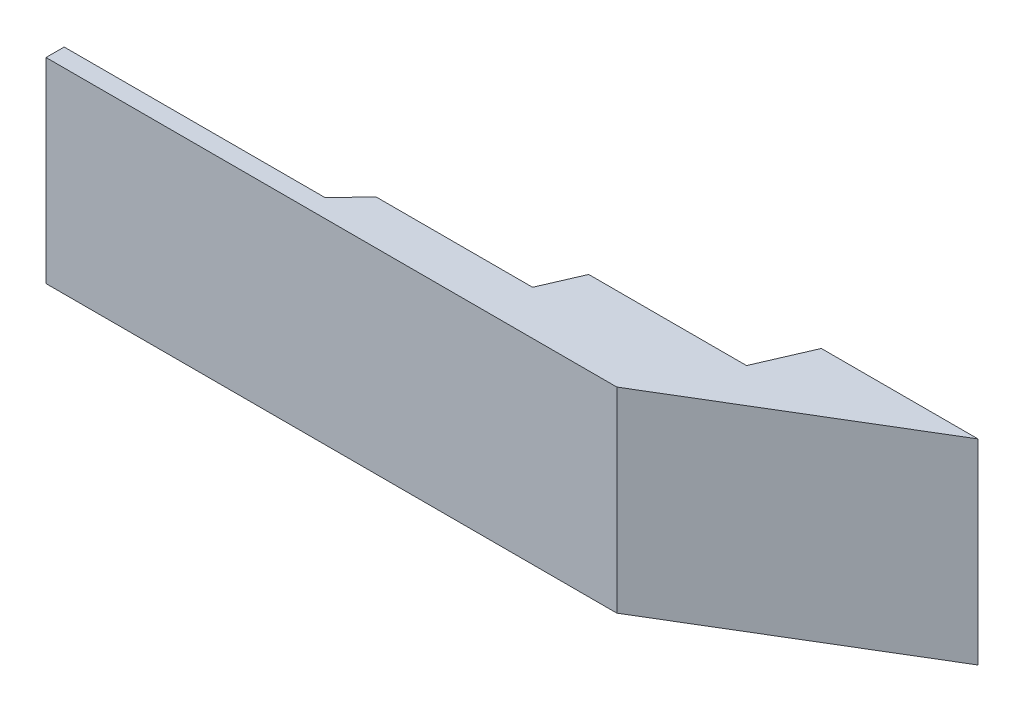
ISO-10303-21;
HEADER;
FILE_DESCRIPTION(('STEP AP214'),'2;1');
FILE_NAME('part.step','',(''),(''),'','','');
FILE_SCHEMA(('AUTOMOTIVE_DESIGN { 1 0 10303 214 1 1 1 1 }'));
ENDSEC;
DATA;
#1=APPLICATION_CONTEXT('core data for automotive mechanical design processes');
#2=APPLICATION_PROTOCOL_DEFINITION('international standard','automotive_design',2000,#1);
#3=PRODUCT_CONTEXT('',#1,'mechanical');
#4=PRODUCT('Part','Part','',(#3));
#5=PRODUCT_RELATED_PRODUCT_CATEGORY('part','',(#4));
#6=PRODUCT_DEFINITION_FORMATION('','',#4);
#7=PRODUCT_DEFINITION_CONTEXT('part definition',#1,'design');
#8=PRODUCT_DEFINITION('design','',#6,#7);
#9=PRODUCT_DEFINITION_SHAPE('','',#8);
#10=(LENGTH_UNIT() NAMED_UNIT(*) SI_UNIT(.MILLI.,.METRE.));
#11=(NAMED_UNIT(*) PLANE_ANGLE_UNIT() SI_UNIT($,.RADIAN.));
#12=(NAMED_UNIT(*) SI_UNIT($,.STERADIAN.) SOLID_ANGLE_UNIT());
#13=UNCERTAINTY_MEASURE_WITH_UNIT(LENGTH_MEASURE(1.E-05),#10,'distance_accuracy_value','');
#14=(GEOMETRIC_REPRESENTATION_CONTEXT(3) GLOBAL_UNCERTAINTY_ASSIGNED_CONTEXT((#13)) GLOBAL_UNIT_ASSIGNED_CONTEXT((#10,
#11,#12)) REPRESENTATION_CONTEXT('',''));
#15=CARTESIAN_POINT('',(0.,0.,0.));
#16=DIRECTION('',(0.,0.,1.));
#17=DIRECTION('',(1.,0.,0.));
#18=AXIS2_PLACEMENT_3D('',#15,#16,#17);
#19=CARTESIAN_POINT('',(-2629.10447761194,1500.,0.));
#20=DIRECTION('',(1.,0.,0.));
#21=DIRECTION('',(0.,0.,-1.));
#22=AXIS2_PLACEMENT_3D('',#19,#20,#21);
#23=PLANE('',#22);
#24=DIRECTION('',(0.,0.,1.));
#25=VECTOR('',#24,1.);
#26=CARTESIAN_POINT('',(-2629.10447761194,0.,0.));
#27=LINE('',#26,#25);
#28=CARTESIAN_POINT('',(-2629.10447761194,0.,0.));
#29=VERTEX_POINT('',#28);
#30=CARTESIAN_POINT('',(-2629.10447761194,0.,139.280385583997));
#31=VERTEX_POINT('',#30);
#32=EDGE_CURVE('E140',#29,#31,#27,.T.);
#33=ORIENTED_EDGE('',*,*,#32,.T.);
#34=DIRECTION('',(0.,-1.,0.));
#35=VECTOR('',#34,1.);
#36=CARTESIAN_POINT('',(-2629.10447761194,1500.,139.280385583997));
#37=LINE('',#36,#35);
#38=CARTESIAN_POINT('',(-2629.10447761194,1500.,139.280385583997));
#39=VERTEX_POINT('',#38);
#40=EDGE_CURVE('E11',#39,#31,#37,.T.);
#41=ORIENTED_EDGE('',*,*,#40,.F.);
#42=DIRECTION('',(0.,0.,1.));
#43=VECTOR('',#42,1.);
#44=CARTESIAN_POINT('',(-2629.10447761194,1500.,0.));
#45=LINE('',#44,#43);
#46=CARTESIAN_POINT('',(-2629.10447761194,1500.,0.));
#47=VERTEX_POINT('',#46);
#48=EDGE_CURVE('E159',#47,#39,#45,.T.);
#49=ORIENTED_EDGE('',*,*,#48,.F.);
#50=DIRECTION('',(0.,-1.,0.));
#51=VECTOR('',#50,1.);
#52=CARTESIAN_POINT('',(-2629.10447761194,1500.,0.));
#53=LINE('',#52,#51);
#54=EDGE_CURVE('E136',#47,#29,#53,.T.);
#55=ORIENTED_EDGE('',*,*,#54,.T.);
#56=EDGE_LOOP('',(#33,#41,#49,#55));
#57=FACE_BOUND('',#56,.T.);
#58=ADVANCED_FACE('F33',(#57),#23,.F.);
#59=CARTESIAN_POINT('',(-2629.10447761194,1500.,139.280385583997));
#60=DIRECTION('',(0.,0.,-1.));
#61=DIRECTION('',(-1.,0.,0.));
#62=AXIS2_PLACEMENT_3D('',#59,#60,#61);
#63=PLANE('',#62);
#64=DIRECTION('',(1.,0.,0.));
#65=VECTOR('',#64,1.);
#66=CARTESIAN_POINT('',(-2629.10447761194,0.,139.280385583997));
#67=LINE('',#66,#65);
#68=CARTESIAN_POINT('',(1743.37575444087,0.,139.280385583997));
#69=VERTEX_POINT('',#68);
#70=EDGE_CURVE('E143',#31,#69,#67,.T.);
#71=ORIENTED_EDGE('',*,*,#70,.T.);
#72=DIRECTION('',(0.,-1.,0.));
#73=VECTOR('',#72,1.);
#74=CARTESIAN_POINT('',(1743.37575444087,1500.,139.280385583997));
#75=LINE('',#74,#73);
#76=CARTESIAN_POINT('',(1743.37575444087,1500.,139.280385583997));
#77=VERTEX_POINT('',#76);
#78=EDGE_CURVE('E41',#77,#69,#75,.T.);
#79=ORIENTED_EDGE('',*,*,#78,.F.);
#80=DIRECTION('',(1.,0.,0.));
#81=VECTOR('',#80,1.);
#82=CARTESIAN_POINT('',(-2629.10447761194,1500.,139.280385583997));
#83=LINE('',#82,#81);
#84=EDGE_CURVE('E98',#39,#77,#83,.T.);
#85=ORIENTED_EDGE('',*,*,#84,.F.);
#86=ORIENTED_EDGE('',*,*,#40,.T.);
#87=EDGE_LOOP('',(#71,#79,#85,#86));
#88=FACE_BOUND('',#87,.T.);
#89=ADVANCED_FACE('F208',(#88),#63,.F.);
#90=CARTESIAN_POINT('',(1743.37575444087,1500.,139.280385583997));
#91=DIRECTION('',(-0.51550513923268,0.,-0.85688648689584));
#92=DIRECTION('',(-0.85688648689584,0.,0.51550513923268));
#93=AXIS2_PLACEMENT_3D('',#90,#91,#92);
#94=PLANE('',#93);
#95=DIRECTION('',(0.85688648689584,0.,-0.51550513923268));
#96=VECTOR('',#95,1.);
#97=CARTESIAN_POINT('',(1743.37575444087,0.,139.280385583997));
#98=LINE('',#97,#96);
#99=CARTESIAN_POINT('',(3470.89552238806,0.,-900.));
#100=VERTEX_POINT('',#99);
#101=EDGE_CURVE('E145',#69,#100,#98,.T.);
#102=ORIENTED_EDGE('',*,*,#101,.T.);
#103=DIRECTION('',(0.,-1.,0.));
#104=VECTOR('',#103,1.);
#105=CARTESIAN_POINT('',(3470.89552238806,1500.,-900.));
#106=LINE('',#105,#104);
#107=CARTESIAN_POINT('',(3470.89552238806,1500.,-900.));
#108=VERTEX_POINT('',#107);
#109=EDGE_CURVE('E172',#108,#100,#106,.T.);
#110=ORIENTED_EDGE('',*,*,#109,.F.);
#111=DIRECTION('',(0.85688648689584,0.,-0.51550513923268));
#112=VECTOR('',#111,1.);
#113=CARTESIAN_POINT('',(1743.37575444087,1500.,139.280385583997));
#114=LINE('',#113,#112);
#115=EDGE_CURVE('E180',#77,#108,#114,.T.);
#116=ORIENTED_EDGE('',*,*,#115,.F.);
#117=ORIENTED_EDGE('',*,*,#78,.T.);
#118=EDGE_LOOP('',(#102,#110,#116,#117));
#119=FACE_BOUND('',#118,.T.);
#120=ADVANCED_FACE('F178',(#119),#94,.F.);
#121=CARTESIAN_POINT('',(2270.89552238806,1500.,-900.));
#122=DIRECTION('',(0.,0.,1.));
#123=DIRECTION('',(1.,0.,0.));
#124=AXIS2_PLACEMENT_3D('',#121,#122,#123);
#125=PLANE('',#124);
#126=DIRECTION('',(-1.,0.,0.));
#127=VECTOR('',#126,1.);
#128=CARTESIAN_POINT('',(2270.89552238806,0.,-900.));
#129=LINE('',#128,#127);
#130=CARTESIAN_POINT('',(2270.89552238806,0.,-900.));
#131=VERTEX_POINT('',#130);
#132=EDGE_CURVE('E147',#100,#131,#129,.T.);
#133=ORIENTED_EDGE('',*,*,#132,.T.);
#134=DIRECTION('',(0.,-1.,0.));
#135=VECTOR('',#134,1.);
#136=CARTESIAN_POINT('',(2270.89552238806,1500.,-900.));
#137=LINE('',#136,#135);
#138=CARTESIAN_POINT('',(2270.89552238806,1500.,-900.));
#139=VERTEX_POINT('',#138);
#140=EDGE_CURVE('E169',#139,#131,#137,.T.);
#141=ORIENTED_EDGE('',*,*,#140,.F.);
#142=DIRECTION('',(-1.,0.,0.));
#143=VECTOR('',#142,1.);
#144=CARTESIAN_POINT('',(2270.89552238806,1500.,-900.));
#145=LINE('',#144,#143);
#146=EDGE_CURVE('E198',#108,#139,#145,.T.);
#147=ORIENTED_EDGE('',*,*,#146,.F.);
#148=ORIENTED_EDGE('',*,*,#109,.T.);
#149=EDGE_LOOP('',(#133,#141,#147,#148));
#150=FACE_BOUND('',#149,.T.);
#151=ADVANCED_FACE('F189',(#150),#125,.F.);
#152=CARTESIAN_POINT('',(2097.76119402985,1500.,-500.));
#153=DIRECTION('',(0.917722116807314,0.,0.397223005782271));
#154=DIRECTION('',(0.397223005782271,0.,-0.917722116807314));
#155=AXIS2_PLACEMENT_3D('',#152,#153,#154);
#156=PLANE('',#155);
#157=DIRECTION('',(-0.397223005782271,0.,0.917722116807314));
#158=VECTOR('',#157,1.);
#159=CARTESIAN_POINT('',(2097.76119402985,0.,-500.));
#160=LINE('',#159,#158);
#161=CARTESIAN_POINT('',(2097.76119402985,0.,-500.));
#162=VERTEX_POINT('',#161);
#163=EDGE_CURVE('E149',#131,#162,#160,.T.);
#164=ORIENTED_EDGE('',*,*,#163,.T.);
#165=DIRECTION('',(0.,-1.,0.));
#166=VECTOR('',#165,1.);
#167=CARTESIAN_POINT('',(2097.76119402985,1500.,-500.));
#168=LINE('',#167,#166);
#169=CARTESIAN_POINT('',(2097.76119402985,1500.,-500.));
#170=VERTEX_POINT('',#169);
#171=EDGE_CURVE('E166',#170,#162,#168,.T.);
#172=ORIENTED_EDGE('',*,*,#171,.F.);
#173=DIRECTION('',(-0.397223005782271,0.,0.917722116807314));
#174=VECTOR('',#173,1.);
#175=CARTESIAN_POINT('',(2097.76119402985,1500.,-500.));
#176=LINE('',#175,#174);
#177=EDGE_CURVE('E195',#139,#170,#176,.T.);
#178=ORIENTED_EDGE('',*,*,#177,.F.);
#179=ORIENTED_EDGE('',*,*,#140,.T.);
#180=EDGE_LOOP('',(#164,#172,#178,#179));
#181=FACE_BOUND('',#180,.T.);
#182=ADVANCED_FACE('F193',(#181),#156,.F.);
#183=CARTESIAN_POINT('',(888.805970149254,1500.,-500.));
#184=DIRECTION('',(0.,0.,1.));
#185=DIRECTION('',(1.,0.,0.));
#186=AXIS2_PLACEMENT_3D('',#183,#184,#185);
#187=PLANE('',#186);
#188=DIRECTION('',(-1.,0.,0.));
#189=VECTOR('',#188,1.);
#190=CARTESIAN_POINT('',(888.805970149254,0.,-500.));
#191=LINE('',#190,#189);
#192=CARTESIAN_POINT('',(888.805970149254,0.,-500.));
#193=VERTEX_POINT('',#192);
#194=EDGE_CURVE('E151',#162,#193,#191,.T.);
#195=ORIENTED_EDGE('',*,*,#194,.T.);
#196=DIRECTION('',(0.,-1.,0.));
#197=VECTOR('',#196,1.);
#198=CARTESIAN_POINT('',(888.805970149254,1500.,-500.));
#199=LINE('',#198,#197);
#200=CARTESIAN_POINT('',(888.805970149254,1500.,-500.));
#201=VERTEX_POINT('',#200);
#202=EDGE_CURVE('E163',#201,#193,#199,.T.);
#203=ORIENTED_EDGE('',*,*,#202,.F.);
#204=DIRECTION('',(-1.,0.,0.));
#205=VECTOR('',#204,1.);
#206=CARTESIAN_POINT('',(888.805970149254,1500.,-500.));
#207=LINE('',#206,#205);
#208=EDGE_CURVE('E197',#170,#201,#207,.T.);
#209=ORIENTED_EDGE('',*,*,#208,.F.);
#210=ORIENTED_EDGE('',*,*,#171,.T.);
#211=EDGE_LOOP('',(#195,#203,#209,#210));
#212=FACE_BOUND('',#211,.T.);
#213=ADVANCED_FACE('F220',(#212),#187,.F.);
#214=CARTESIAN_POINT('',(758.955223880597,1500.,-200.));
#215=DIRECTION('',(0.917722116807314,0.,0.397223005782271));
#216=DIRECTION('',(0.397223005782271,0.,-0.917722116807315));
#217=AXIS2_PLACEMENT_3D('',#214,#215,#216);
#218=PLANE('',#217);
#219=DIRECTION('',(-0.397223005782271,0.,0.917722116807315));
#220=VECTOR('',#219,1.);
#221=CARTESIAN_POINT('',(758.955223880597,0.,-200.));
#222=LINE('',#221,#220);
#223=CARTESIAN_POINT('',(758.955223880597,0.,-200.));
#224=VERTEX_POINT('',#223);
#225=EDGE_CURVE('E153',#193,#224,#222,.T.);
#226=ORIENTED_EDGE('',*,*,#225,.T.);
#227=DIRECTION('',(0.,-1.,0.));
#228=VECTOR('',#227,1.);
#229=CARTESIAN_POINT('',(758.955223880597,1500.,-200.));
#230=LINE('',#229,#228);
#231=CARTESIAN_POINT('',(758.955223880597,1500.,-200.));
#232=VERTEX_POINT('',#231);
#233=EDGE_CURVE('E131',#232,#224,#230,.T.);
#234=ORIENTED_EDGE('',*,*,#233,.F.);
#235=DIRECTION('',(-0.397223005782271,0.,0.917722116807315));
#236=VECTOR('',#235,1.);
#237=CARTESIAN_POINT('',(758.955223880597,1500.,-200.));
#238=LINE('',#237,#236);
#239=EDGE_CURVE('E123',#201,#232,#238,.T.);
#240=ORIENTED_EDGE('',*,*,#239,.F.);
#241=ORIENTED_EDGE('',*,*,#202,.T.);
#242=EDGE_LOOP('',(#226,#234,#240,#241));
#243=FACE_BOUND('',#242,.T.);
#244=ADVANCED_FACE('F223',(#243),#218,.F.);
#245=CARTESIAN_POINT('',(-441.044776119403,1500.,-200.));
#246=DIRECTION('',(0.,0.,1.));
#247=DIRECTION('',(1.,0.,0.));
#248=AXIS2_PLACEMENT_3D('',#245,#246,#247);
#249=PLANE('',#248);
#250=DIRECTION('',(-1.,0.,0.));
#251=VECTOR('',#250,1.);
#252=CARTESIAN_POINT('',(-441.044776119403,0.,-200.));
#253=LINE('',#252,#251);
#254=CARTESIAN_POINT('',(-441.044776119403,0.,-200.));
#255=VERTEX_POINT('',#254);
#256=EDGE_CURVE('E130',#224,#255,#253,.T.);
#257=ORIENTED_EDGE('',*,*,#256,.T.);
#258=DIRECTION('',(0.,-1.,0.));
#259=VECTOR('',#258,1.);
#260=CARTESIAN_POINT('',(-441.044776119403,1500.,-200.));
#261=LINE('',#260,#259);
#262=CARTESIAN_POINT('',(-441.044776119403,1500.,-200.));
#263=VERTEX_POINT('',#262);
#264=EDGE_CURVE('E128',#263,#255,#261,.T.);
#265=ORIENTED_EDGE('',*,*,#264,.F.);
#266=DIRECTION('',(-1.,0.,0.));
#267=VECTOR('',#266,1.);
#268=CARTESIAN_POINT('',(29.1044776119398,1500.,-200.));
#269=LINE('',#268,#267);
#270=EDGE_CURVE('E117',#232,#263,#269,.T.);
#271=ORIENTED_EDGE('',*,*,#270,.F.);
#272=ORIENTED_EDGE('',*,*,#233,.T.);
#273=EDGE_LOOP('',(#257,#265,#271,#272));
#274=FACE_BOUND('',#273,.T.);
#275=ADVANCED_FACE('F129',(#274),#249,.F.);
#276=CARTESIAN_POINT('',(-629.104477611941,1500.,0.));
#277=DIRECTION('',(0.72851913337246,0.,0.685025453768135));
#278=DIRECTION('',(0.685025453768135,0.,-0.72851913337246));
#279=AXIS2_PLACEMENT_3D('',#276,#277,#278);
#280=PLANE('',#279);
#281=DIRECTION('',(-0.685025453768136,0.,0.72851913337246));
#282=VECTOR('',#281,1.);
#283=CARTESIAN_POINT('',(-629.104477611941,0.,0.));
#284=LINE('',#283,#282);
#285=CARTESIAN_POINT('',(-629.104477611941,0.,0.));
#286=VERTEX_POINT('',#285);
#287=EDGE_CURVE('E84',#255,#286,#284,.T.);
#288=ORIENTED_EDGE('',*,*,#287,.T.);
#289=DIRECTION('',(0.,-1.,0.));
#290=VECTOR('',#289,1.);
#291=CARTESIAN_POINT('',(-629.104477611941,1500.,0.));
#292=LINE('',#291,#290);
#293=CARTESIAN_POINT('',(-629.104477611941,1500.,0.));
#294=VERTEX_POINT('',#293);
#295=EDGE_CURVE('E132',#294,#286,#292,.T.);
#296=ORIENTED_EDGE('',*,*,#295,.F.);
#297=DIRECTION('',(-0.685025453768136,0.,0.72851913337246));
#298=VECTOR('',#297,1.);
#299=CARTESIAN_POINT('',(-629.104477611941,1500.,0.));
#300=LINE('',#299,#298);
#301=EDGE_CURVE('E121',#263,#294,#300,.T.);
#302=ORIENTED_EDGE('',*,*,#301,.F.);
#303=ORIENTED_EDGE('',*,*,#264,.T.);
#304=EDGE_LOOP('',(#288,#296,#302,#303));
#305=FACE_BOUND('',#304,.T.);
#306=ADVANCED_FACE('F134',(#305),#280,.F.);
#307=CARTESIAN_POINT('',(-2629.10447761194,1500.,0.));
#308=DIRECTION('',(0.,0.,1.));
#309=DIRECTION('',(1.,0.,0.));
#310=AXIS2_PLACEMENT_3D('',#307,#308,#309);
#311=PLANE('',#310);
#312=DIRECTION('',(-1.,0.,0.));
#313=VECTOR('',#312,1.);
#314=CARTESIAN_POINT('',(-2629.10447761194,0.,0.));
#315=LINE('',#314,#313);
#316=EDGE_CURVE('E90',#286,#29,#315,.T.);
#317=ORIENTED_EDGE('',*,*,#316,.T.);
#318=ORIENTED_EDGE('',*,*,#54,.F.);
#319=DIRECTION('',(-1.,0.,0.));
#320=VECTOR('',#319,1.);
#321=CARTESIAN_POINT('',(-2629.10447761194,1500.,0.));
#322=LINE('',#321,#320);
#323=EDGE_CURVE('E49',#294,#47,#322,.T.);
#324=ORIENTED_EDGE('',*,*,#323,.F.);
#325=ORIENTED_EDGE('',*,*,#295,.T.);
#326=EDGE_LOOP('',(#317,#318,#324,#325));
#327=FACE_BOUND('',#326,.T.);
#328=ADVANCED_FACE('F232',(#327),#311,.F.);
#329=CARTESIAN_POINT('',(0.,1500.,0.));
#330=DIRECTION('',(0.,1.,0.));
#331=DIRECTION('',(0.,0.,1.));
#332=AXIS2_PLACEMENT_3D('',#329,#330,#331);
#333=PLANE('',#332);
#334=ORIENTED_EDGE('',*,*,#48,.T.);
#335=ORIENTED_EDGE('',*,*,#84,.T.);
#336=ORIENTED_EDGE('',*,*,#115,.T.);
#337=ORIENTED_EDGE('',*,*,#146,.T.);
#338=ORIENTED_EDGE('',*,*,#177,.T.);
#339=ORIENTED_EDGE('',*,*,#208,.T.);
#340=ORIENTED_EDGE('',*,*,#239,.T.);
#341=ORIENTED_EDGE('',*,*,#270,.T.);
#342=ORIENTED_EDGE('',*,*,#301,.T.);
#343=ORIENTED_EDGE('',*,*,#323,.T.);
#344=EDGE_LOOP('',(#334,#335,#336,#337,#338,#339,#340,#341,#342,#343));
#345=FACE_BOUND('',#344,.T.);
#346=ADVANCED_FACE('F119',(#345),#333,.T.);
#347=CARTESIAN_POINT('',(0.,0.,0.));
#348=DIRECTION('',(0.,1.,0.));
#349=DIRECTION('',(0.,0.,1.));
#350=AXIS2_PLACEMENT_3D('',#347,#348,#349);
#351=PLANE('',#350);
#352=ORIENTED_EDGE('',*,*,#32,.F.);
#353=ORIENTED_EDGE('',*,*,#316,.F.);
#354=ORIENTED_EDGE('',*,*,#287,.F.);
#355=ORIENTED_EDGE('',*,*,#256,.F.);
#356=ORIENTED_EDGE('',*,*,#225,.F.);
#357=ORIENTED_EDGE('',*,*,#194,.F.);
#358=ORIENTED_EDGE('',*,*,#163,.F.);
#359=ORIENTED_EDGE('',*,*,#132,.F.);
#360=ORIENTED_EDGE('',*,*,#101,.F.);
#361=ORIENTED_EDGE('',*,*,#70,.F.);
#362=EDGE_LOOP('',(#352,#353,#354,#355,#356,#357,#358,#359,#360,#361));
#363=FACE_BOUND('',#362,.T.);
#364=ADVANCED_FACE('F184',(#363),#351,.F.);
#365=CLOSED_SHELL('',(#58,#89,#120,#151,#182,#213,#244,#275,#306,#328,#346,#364));
#366=MANIFOLD_SOLID_BREP('B2',#365);
#367=ADVANCED_BREP_SHAPE_REPRESENTATION('',(#18,#366),#14);
#368=SHAPE_DEFINITION_REPRESENTATION(#9,#367);
ENDSEC;
END-ISO-10303-21;
